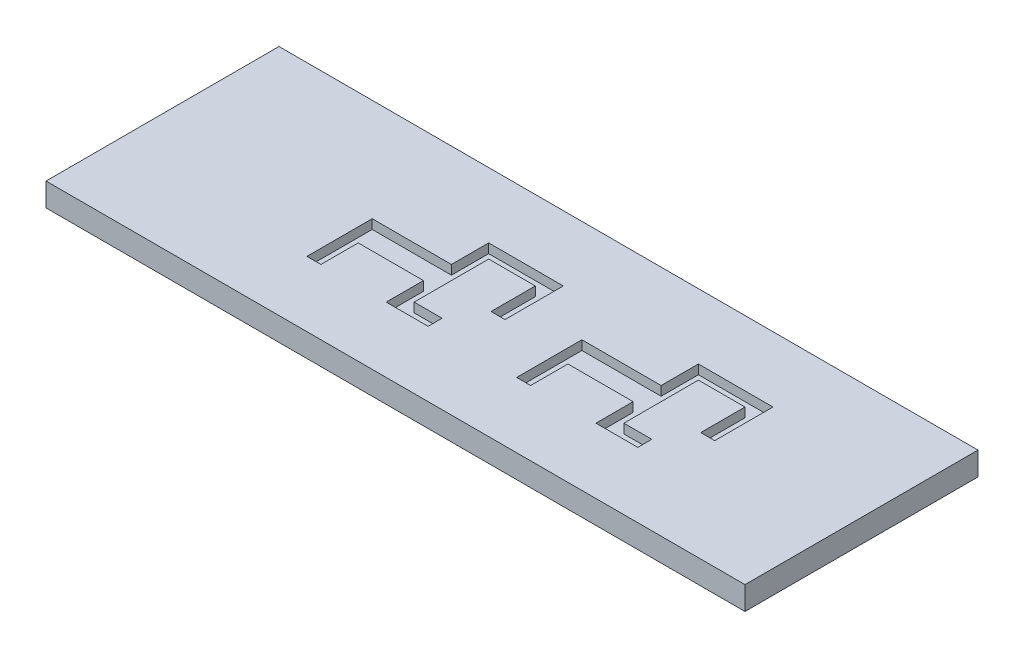
ISO-10303-21;
HEADER;
FILE_DESCRIPTION(('STEP AP214'),'2;1');
FILE_NAME('part.step','',(''),(''),'','','');
FILE_SCHEMA(('AUTOMOTIVE_DESIGN { 1 0 10303 214 1 1 1 1 }'));
ENDSEC;
DATA;
#1=APPLICATION_CONTEXT('core data for automotive mechanical design processes');
#2=APPLICATION_PROTOCOL_DEFINITION('international standard','automotive_design',2000,#1);
#3=PRODUCT_CONTEXT('',#1,'mechanical');
#4=PRODUCT('Part','Part','',(#3));
#5=PRODUCT_RELATED_PRODUCT_CATEGORY('part','',(#4));
#6=PRODUCT_DEFINITION_FORMATION('','',#4);
#7=PRODUCT_DEFINITION_CONTEXT('part definition',#1,'design');
#8=PRODUCT_DEFINITION('design','',#6,#7);
#9=PRODUCT_DEFINITION_SHAPE('','',#8);
#10=(LENGTH_UNIT() NAMED_UNIT(*) SI_UNIT(.MILLI.,.METRE.));
#11=(NAMED_UNIT(*) PLANE_ANGLE_UNIT() SI_UNIT($,.RADIAN.));
#12=(NAMED_UNIT(*) SI_UNIT($,.STERADIAN.) SOLID_ANGLE_UNIT());
#13=UNCERTAINTY_MEASURE_WITH_UNIT(LENGTH_MEASURE(1.E-05),#10,'distance_accuracy_value','');
#14=(GEOMETRIC_REPRESENTATION_CONTEXT(3) GLOBAL_UNCERTAINTY_ASSIGNED_CONTEXT((#13)) GLOBAL_UNIT_ASSIGNED_CONTEXT((#10,
#11,#12)) REPRESENTATION_CONTEXT('',''));
#15=CARTESIAN_POINT('',(0.,0.,0.));
#16=DIRECTION('',(0.,0.,1.));
#17=DIRECTION('',(1.,0.,0.));
#18=AXIS2_PLACEMENT_3D('',#15,#16,#17);
#19=CARTESIAN_POINT('',(37.5,2.5,12.5));
#20=DIRECTION('',(-1.,0.,0.));
#21=DIRECTION('',(0.,0.,1.));
#22=AXIS2_PLACEMENT_3D('',#19,#20,#21);
#23=PLANE('',#22);
#24=DIRECTION('',(0.,0.,-1.));
#25=VECTOR('',#24,1.);
#26=CARTESIAN_POINT('',(37.5,0.,12.5));
#27=LINE('',#26,#25);
#28=CARTESIAN_POINT('',(37.5,0.,12.5));
#29=VERTEX_POINT('',#28);
#30=CARTESIAN_POINT('',(37.5,0.,-12.5));
#31=VERTEX_POINT('',#30);
#32=EDGE_CURVE('E545',#29,#31,#27,.T.);
#33=ORIENTED_EDGE('',*,*,#32,.T.);
#34=DIRECTION('',(0.,-1.,0.));
#35=VECTOR('',#34,1.);
#36=CARTESIAN_POINT('',(37.5,2.5,-12.5));
#37=LINE('',#36,#35);
#38=CARTESIAN_POINT('',(37.5,2.5,-12.5));
#39=VERTEX_POINT('',#38);
#40=EDGE_CURVE('E12',#39,#31,#37,.T.);
#41=ORIENTED_EDGE('',*,*,#40,.F.);
#42=DIRECTION('',(0.,0.,-1.));
#43=VECTOR('',#42,1.);
#44=CARTESIAN_POINT('',(37.5,2.5,12.5));
#45=LINE('',#44,#43);
#46=CARTESIAN_POINT('',(37.5,2.5,12.5));
#47=VERTEX_POINT('',#46);
#48=EDGE_CURVE('E575',#47,#39,#45,.T.);
#49=ORIENTED_EDGE('',*,*,#48,.F.);
#50=DIRECTION('',(0.,-1.,0.));
#51=VECTOR('',#50,1.);
#52=CARTESIAN_POINT('',(37.5,2.5,12.5));
#53=LINE('',#52,#51);
#54=EDGE_CURVE('E585',#47,#29,#53,.T.);
#55=ORIENTED_EDGE('',*,*,#54,.T.);
#56=EDGE_LOOP('',(#33,#41,#49,#55));
#57=FACE_BOUND('',#56,.T.);
#58=ADVANCED_FACE('F93',(#57),#23,.F.);
#59=CARTESIAN_POINT('',(-37.5,2.5,-12.5));
#60=DIRECTION('',(0.,0.,1.));
#61=DIRECTION('',(1.,0.,0.));
#62=AXIS2_PLACEMENT_3D('',#59,#60,#61);
#63=PLANE('',#62);
#64=DIRECTION('',(-1.,0.,0.));
#65=VECTOR('',#64,1.);
#66=CARTESIAN_POINT('',(-37.5,0.,-12.5));
#67=LINE('',#66,#65);
#68=CARTESIAN_POINT('',(-37.5,0.,-12.5));
#69=VERTEX_POINT('',#68);
#70=EDGE_CURVE('E588',#31,#69,#67,.T.);
#71=ORIENTED_EDGE('',*,*,#70,.T.);
#72=DIRECTION('',(0.,-1.,0.));
#73=VECTOR('',#72,1.);
#74=CARTESIAN_POINT('',(-37.5,2.5,-12.5));
#75=LINE('',#74,#73);
#76=CARTESIAN_POINT('',(-37.5,2.5,-12.5));
#77=VERTEX_POINT('',#76);
#78=EDGE_CURVE('E100',#77,#69,#75,.T.);
#79=ORIENTED_EDGE('',*,*,#78,.F.);
#80=DIRECTION('',(-1.,0.,0.));
#81=VECTOR('',#80,1.);
#82=CARTESIAN_POINT('',(-37.5,2.5,-12.5));
#83=LINE('',#82,#81);
#84=EDGE_CURVE('E578',#39,#77,#83,.T.);
#85=ORIENTED_EDGE('',*,*,#84,.F.);
#86=ORIENTED_EDGE('',*,*,#40,.T.);
#87=EDGE_LOOP('',(#71,#79,#85,#86));
#88=FACE_BOUND('',#87,.T.);
#89=ADVANCED_FACE('F617',(#88),#63,.F.);
#90=CARTESIAN_POINT('',(-37.5,2.5,12.5));
#91=DIRECTION('',(1.,0.,0.));
#92=DIRECTION('',(0.,0.,-1.));
#93=AXIS2_PLACEMENT_3D('',#90,#91,#92);
#94=PLANE('',#93);
#95=DIRECTION('',(0.,0.,1.));
#96=VECTOR('',#95,1.);
#97=CARTESIAN_POINT('',(-37.5,0.,12.5));
#98=LINE('',#97,#96);
#99=CARTESIAN_POINT('',(-37.5,0.,12.5));
#100=VERTEX_POINT('',#99);
#101=EDGE_CURVE('E590',#69,#100,#98,.T.);
#102=ORIENTED_EDGE('',*,*,#101,.T.);
#103=DIRECTION('',(0.,-1.,0.));
#104=VECTOR('',#103,1.);
#105=CARTESIAN_POINT('',(-37.5,2.5,12.5));
#106=LINE('',#105,#104);
#107=CARTESIAN_POINT('',(-37.5,2.5,12.5));
#108=VERTEX_POINT('',#107);
#109=EDGE_CURVE('E595',#108,#100,#106,.T.);
#110=ORIENTED_EDGE('',*,*,#109,.F.);
#111=DIRECTION('',(0.,0.,1.));
#112=VECTOR('',#111,1.);
#113=CARTESIAN_POINT('',(-37.5,2.5,12.5));
#114=LINE('',#113,#112);
#115=EDGE_CURVE('E581',#77,#108,#114,.T.);
#116=ORIENTED_EDGE('',*,*,#115,.F.);
#117=ORIENTED_EDGE('',*,*,#78,.T.);
#118=EDGE_LOOP('',(#102,#110,#116,#117));
#119=FACE_BOUND('',#118,.T.);
#120=ADVANCED_FACE('F602',(#119),#94,.F.);
#121=CARTESIAN_POINT('',(-37.5,2.5,12.5));
#122=DIRECTION('',(0.,0.,-1.));
#123=DIRECTION('',(-1.,0.,0.));
#124=AXIS2_PLACEMENT_3D('',#121,#122,#123);
#125=PLANE('',#124);
#126=DIRECTION('',(1.,0.,0.));
#127=VECTOR('',#126,1.);
#128=CARTESIAN_POINT('',(-37.5,0.,12.5));
#129=LINE('',#128,#127);
#130=EDGE_CURVE('E579',#100,#29,#129,.T.);
#131=ORIENTED_EDGE('',*,*,#130,.T.);
#132=ORIENTED_EDGE('',*,*,#54,.F.);
#133=DIRECTION('',(1.,0.,0.));
#134=VECTOR('',#133,1.);
#135=CARTESIAN_POINT('',(-37.5,2.5,12.5));
#136=LINE('',#135,#134);
#137=EDGE_CURVE('E583',#108,#47,#136,.T.);
#138=ORIENTED_EDGE('',*,*,#137,.F.);
#139=ORIENTED_EDGE('',*,*,#109,.T.);
#140=EDGE_LOOP('',(#131,#132,#138,#139));
#141=FACE_BOUND('',#140,.T.);
#142=ADVANCED_FACE('F611',(#141),#125,.F.);
#143=CARTESIAN_POINT('',(0.,2.5,0.));
#144=DIRECTION('',(0.,-1.,0.));
#145=DIRECTION('',(0.,0.,-1.));
#146=AXIS2_PLACEMENT_3D('',#143,#144,#145);
#147=PLANE('',#146);
#148=DIRECTION('',(0.,0.,1.));
#149=VECTOR('',#148,1.);
#150=CARTESIAN_POINT('',(-1.49999999999999,2.5,-4.));
#151=LINE('',#150,#149);
#152=CARTESIAN_POINT('',(-1.49999999999999,2.5,-4.));
#153=VERTEX_POINT('',#152);
#154=CARTESIAN_POINT('',(-1.49999999999999,2.5,0.75));
#155=VERTEX_POINT('',#154);
#156=EDGE_CURVE('E341',#153,#155,#151,.T.);
#157=ORIENTED_EDGE('',*,*,#156,.F.);
#158=DIRECTION('',(1.,0.,0.));
#159=VECTOR('',#158,1.);
#160=CARTESIAN_POINT('',(0.,2.5,-4.));
#161=LINE('',#160,#159);
#162=CARTESIAN_POINT('',(-6.49999999999999,2.5,-4.));
#163=VERTEX_POINT('',#162);
#164=EDGE_CURVE('E395',#163,#153,#161,.T.);
#165=ORIENTED_EDGE('',*,*,#164,.F.);
#166=DIRECTION('',(0.,0.,-1.));
#167=VECTOR('',#166,1.);
#168=CARTESIAN_POINT('',(-6.49999999999999,2.5,0.));
#169=LINE('',#168,#167);
#170=CARTESIAN_POINT('',(-6.49999999999999,2.5,4.));
#171=VERTEX_POINT('',#170);
#172=EDGE_CURVE('E398',#171,#163,#169,.T.);
#173=ORIENTED_EDGE('',*,*,#172,.F.);
#174=DIRECTION('',(1.,0.,0.));
#175=VECTOR('',#174,1.);
#176=CARTESIAN_POINT('',(0.,2.5,4.));
#177=LINE('',#176,#175);
#178=CARTESIAN_POINT('',(-3.49999999999999,2.5,4.));
#179=VERTEX_POINT('',#178);
#180=EDGE_CURVE('E401',#171,#179,#177,.T.);
#181=ORIENTED_EDGE('',*,*,#180,.T.);
#182=DIRECTION('',(0.,0.,1.));
#183=VECTOR('',#182,1.);
#184=CARTESIAN_POINT('',(-3.49999999999999,2.5,0.));
#185=LINE('',#184,#183);
#186=CARTESIAN_POINT('',(-3.49999999999999,2.5,5.5));
#187=VERTEX_POINT('',#186);
#188=EDGE_CURVE('E404',#179,#187,#185,.T.);
#189=ORIENTED_EDGE('',*,*,#188,.T.);
#190=DIRECTION('',(1.,0.,0.));
#191=VECTOR('',#190,1.);
#192=CARTESIAN_POINT('',(0.,2.5,5.5));
#193=LINE('',#192,#191);
#194=CARTESIAN_POINT('',(-7.99999999999999,2.5,5.5));
#195=VERTEX_POINT('',#194);
#196=EDGE_CURVE('E407',#195,#187,#193,.T.);
#197=ORIENTED_EDGE('',*,*,#196,.F.);
#198=DIRECTION('',(0.,0.,1.));
#199=VECTOR('',#198,1.);
#200=CARTESIAN_POINT('',(-7.99999999999999,2.5,0.));
#201=LINE('',#200,#199);
#202=CARTESIAN_POINT('',(-7.99999999999999,2.5,1.5));
#203=VERTEX_POINT('',#202);
#204=EDGE_CURVE('E410',#203,#195,#201,.T.);
#205=ORIENTED_EDGE('',*,*,#204,.F.);
#206=DIRECTION('',(1.,0.,0.));
#207=VECTOR('',#206,1.);
#208=CARTESIAN_POINT('',(0.,2.5,1.5));
#209=LINE('',#208,#207);
#210=CARTESIAN_POINT('',(-15.,2.5,1.5));
#211=VERTEX_POINT('',#210);
#212=EDGE_CURVE('E413',#211,#203,#209,.T.);
#213=ORIENTED_EDGE('',*,*,#212,.F.);
#214=DIRECTION('',(0.,0.,1.));
#215=VECTOR('',#214,1.);
#216=CARTESIAN_POINT('',(-15.,2.5,0.));
#217=LINE('',#216,#215);
#218=CARTESIAN_POINT('',(-15.,2.5,5.5));
#219=VERTEX_POINT('',#218);
#220=EDGE_CURVE('E416',#211,#219,#217,.T.);
#221=ORIENTED_EDGE('',*,*,#220,.T.);
#222=DIRECTION('',(1.,0.,0.));
#223=VECTOR('',#222,1.);
#224=CARTESIAN_POINT('',(0.,2.5,5.50000000000001));
#225=LINE('',#224,#223);
#226=CARTESIAN_POINT('',(-16.5,2.5,5.5));
#227=VERTEX_POINT('',#226);
#228=EDGE_CURVE('E419',#227,#219,#225,.T.);
#229=ORIENTED_EDGE('',*,*,#228,.F.);
#230=DIRECTION('',(0.,0.,-1.));
#231=VECTOR('',#230,1.);
#232=CARTESIAN_POINT('',(-16.5,2.5,0.));
#233=LINE('',#232,#231);
#234=CARTESIAN_POINT('',(-16.5,2.5,-1.5));
#235=VERTEX_POINT('',#234);
#236=EDGE_CURVE('E334',#227,#235,#233,.T.);
#237=ORIENTED_EDGE('',*,*,#236,.T.);
#238=DIRECTION('',(1.,0.,0.));
#239=VECTOR('',#238,1.);
#240=CARTESIAN_POINT('',(0.,2.5,-1.5));
#241=LINE('',#240,#239);
#242=CARTESIAN_POINT('',(-7.99999999999999,2.5,-1.5));
#243=VERTEX_POINT('',#242);
#244=EDGE_CURVE('E388',#235,#243,#241,.T.);
#245=ORIENTED_EDGE('',*,*,#244,.T.);
#246=DIRECTION('',(0.,0.,-1.));
#247=VECTOR('',#246,1.);
#248=CARTESIAN_POINT('',(-7.99999999999999,2.5,0.));
#249=LINE('',#248,#247);
#250=CARTESIAN_POINT('',(-7.99999999999999,2.5,-5.5));
#251=VERTEX_POINT('',#250);
#252=EDGE_CURVE('E391',#243,#251,#249,.T.);
#253=ORIENTED_EDGE('',*,*,#252,.T.);
#254=DIRECTION('',(1.,0.,0.));
#255=VECTOR('',#254,1.);
#256=CARTESIAN_POINT('',(0.,2.5,-5.5));
#257=LINE('',#256,#255);
#258=CARTESIAN_POINT('',(0.,2.5,-5.5));
#259=VERTEX_POINT('',#258);
#260=EDGE_CURVE('E348',#251,#259,#257,.T.);
#261=ORIENTED_EDGE('',*,*,#260,.T.);
#262=DIRECTION('',(0.,0.,1.));
#263=VECTOR('',#262,1.);
#264=CARTESIAN_POINT('',(0.,2.5,-4.));
#265=LINE('',#264,#263);
#266=CARTESIAN_POINT('',(0.,2.5,0.75));
#267=VERTEX_POINT('',#266);
#268=EDGE_CURVE('E330',#259,#267,#265,.T.);
#269=ORIENTED_EDGE('',*,*,#268,.T.);
#270=DIRECTION('',(-1.,0.,0.));
#271=VECTOR('',#270,1.);
#272=CARTESIAN_POINT('',(0.,2.5,0.75));
#273=LINE('',#272,#271);
#274=EDGE_CURVE('E337',#267,#155,#273,.T.);
#275=ORIENTED_EDGE('',*,*,#274,.T.);
#276=EDGE_LOOP('',(#157,#165,#173,#181,#189,#197,#205,#213,#221,#229,#237,#245,#253,#261,#269,#275));
#277=FACE_BOUND('',#276,.T.);
#278=DIRECTION('',(1.,0.,0.));
#279=VECTOR('',#278,1.);
#280=CARTESIAN_POINT('',(0.,2.5,-4.));
#281=LINE('',#280,#279);
#282=CARTESIAN_POINT('',(16.,2.5,-4.));
#283=VERTEX_POINT('',#282);
#284=CARTESIAN_POINT('',(21.,2.5,-4.));
#285=VERTEX_POINT('',#284);
#286=EDGE_CURVE('E499',#283,#285,#281,.T.);
#287=ORIENTED_EDGE('',*,*,#286,.F.);
#288=DIRECTION('',(0.,0.,-1.));
#289=VECTOR('',#288,1.);
#290=CARTESIAN_POINT('',(16.,2.5,0.));
#291=LINE('',#290,#289);
#292=CARTESIAN_POINT('',(16.,2.5,4.));
#293=VERTEX_POINT('',#292);
#294=EDGE_CURVE('E115',#293,#283,#291,.T.);
#295=ORIENTED_EDGE('',*,*,#294,.F.);
#296=DIRECTION('',(1.,0.,0.));
#297=VECTOR('',#296,1.);
#298=CARTESIAN_POINT('',(0.,2.5,4.));
#299=LINE('',#298,#297);
#300=CARTESIAN_POINT('',(19.,2.5,4.));
#301=VERTEX_POINT('',#300);
#302=EDGE_CURVE('E460',#293,#301,#299,.T.);
#303=ORIENTED_EDGE('',*,*,#302,.T.);
#304=DIRECTION('',(0.,0.,1.));
#305=VECTOR('',#304,1.);
#306=CARTESIAN_POINT('',(19.,2.5,0.));
#307=LINE('',#306,#305);
#308=CARTESIAN_POINT('',(19.,2.5,5.5));
#309=VERTEX_POINT('',#308);
#310=EDGE_CURVE('E538',#301,#309,#307,.T.);
#311=ORIENTED_EDGE('',*,*,#310,.T.);
#312=DIRECTION('',(1.,0.,0.));
#313=VECTOR('',#312,1.);
#314=CARTESIAN_POINT('',(0.,2.5,5.5));
#315=LINE('',#314,#313);
#316=CARTESIAN_POINT('',(14.5,2.5,5.5));
#317=VERTEX_POINT('',#316);
#318=EDGE_CURVE('E535',#317,#309,#315,.T.);
#319=ORIENTED_EDGE('',*,*,#318,.F.);
#320=DIRECTION('',(0.,0.,1.));
#321=VECTOR('',#320,1.);
#322=CARTESIAN_POINT('',(14.5,2.5,0.));
#323=LINE('',#322,#321);
#324=CARTESIAN_POINT('',(14.5,2.5,1.5));
#325=VERTEX_POINT('',#324);
#326=EDGE_CURVE('E532',#325,#317,#323,.T.);
#327=ORIENTED_EDGE('',*,*,#326,.F.);
#328=DIRECTION('',(1.,0.,0.));
#329=VECTOR('',#328,1.);
#330=CARTESIAN_POINT('',(0.,2.5,1.5));
#331=LINE('',#330,#329);
#332=CARTESIAN_POINT('',(7.50000000000001,2.5,1.5));
#333=VERTEX_POINT('',#332);
#334=EDGE_CURVE('E529',#333,#325,#331,.T.);
#335=ORIENTED_EDGE('',*,*,#334,.F.);
#336=DIRECTION('',(0.,0.,1.));
#337=VECTOR('',#336,1.);
#338=CARTESIAN_POINT('',(7.50000000000001,2.5,0.));
#339=LINE('',#338,#337);
#340=CARTESIAN_POINT('',(7.50000000000001,2.5,5.5));
#341=VERTEX_POINT('',#340);
#342=EDGE_CURVE('E526',#333,#341,#339,.T.);
#343=ORIENTED_EDGE('',*,*,#342,.T.);
#344=DIRECTION('',(1.,0.,0.));
#345=VECTOR('',#344,1.);
#346=CARTESIAN_POINT('',(0.,2.5,5.5));
#347=LINE('',#346,#345);
#348=CARTESIAN_POINT('',(6.00000000000001,2.5,5.5));
#349=VERTEX_POINT('',#348);
#350=EDGE_CURVE('E523',#349,#341,#347,.T.);
#351=ORIENTED_EDGE('',*,*,#350,.F.);
#352=DIRECTION('',(0.,0.,-1.));
#353=VECTOR('',#352,1.);
#354=CARTESIAN_POINT('',(6.00000000000001,2.5,0.));
#355=LINE('',#354,#353);
#356=CARTESIAN_POINT('',(6.00000000000001,2.5,-1.5));
#357=VERTEX_POINT('',#356);
#358=EDGE_CURVE('E520',#349,#357,#355,.T.);
#359=ORIENTED_EDGE('',*,*,#358,.T.);
#360=DIRECTION('',(1.,0.,0.));
#361=VECTOR('',#360,1.);
#362=CARTESIAN_POINT('',(0.,2.5,-1.5));
#363=LINE('',#362,#361);
#364=CARTESIAN_POINT('',(14.5,2.5,-1.5));
#365=VERTEX_POINT('',#364);
#366=EDGE_CURVE('E517',#357,#365,#363,.T.);
#367=ORIENTED_EDGE('',*,*,#366,.T.);
#368=DIRECTION('',(0.,0.,-1.));
#369=VECTOR('',#368,1.);
#370=CARTESIAN_POINT('',(14.5,2.5,0.));
#371=LINE('',#370,#369);
#372=CARTESIAN_POINT('',(14.5,2.5,-5.5));
#373=VERTEX_POINT('',#372);
#374=EDGE_CURVE('E514',#365,#373,#371,.T.);
#375=ORIENTED_EDGE('',*,*,#374,.T.);
#376=DIRECTION('',(1.,0.,0.));
#377=VECTOR('',#376,1.);
#378=CARTESIAN_POINT('',(0.,2.5,-5.5));
#379=LINE('',#378,#377);
#380=CARTESIAN_POINT('',(22.5,2.5,-5.5));
#381=VERTEX_POINT('',#380);
#382=EDGE_CURVE('E511',#373,#381,#379,.T.);
#383=ORIENTED_EDGE('',*,*,#382,.T.);
#384=DIRECTION('',(0.,0.,-1.));
#385=VECTOR('',#384,1.);
#386=CARTESIAN_POINT('',(22.5,2.5,0.));
#387=LINE('',#386,#385);
#388=CARTESIAN_POINT('',(22.5,2.5,0.75));
#389=VERTEX_POINT('',#388);
#390=EDGE_CURVE('E508',#389,#381,#387,.T.);
#391=ORIENTED_EDGE('',*,*,#390,.F.);
#392=DIRECTION('',(-1.,0.,0.));
#393=VECTOR('',#392,1.);
#394=CARTESIAN_POINT('',(0.,2.5,0.750000000000001));
#395=LINE('',#394,#393);
#396=CARTESIAN_POINT('',(21.,2.5,0.75));
#397=VERTEX_POINT('',#396);
#398=EDGE_CURVE('E505',#389,#397,#395,.T.);
#399=ORIENTED_EDGE('',*,*,#398,.T.);
#400=DIRECTION('',(0.,0.,1.));
#401=VECTOR('',#400,1.);
#402=CARTESIAN_POINT('',(21.,2.5,0.));
#403=LINE('',#402,#401);
#404=EDGE_CURVE('E502',#285,#397,#403,.T.);
#405=ORIENTED_EDGE('',*,*,#404,.F.);
#406=EDGE_LOOP('',(#287,#295,#303,#311,#319,#327,#335,#343,#351,#359,#367,#375,#383,#391,#399,#405));
#407=FACE_BOUND('',#406,.T.);
#408=ORIENTED_EDGE('',*,*,#48,.T.);
#409=ORIENTED_EDGE('',*,*,#84,.T.);
#410=ORIENTED_EDGE('',*,*,#115,.T.);
#411=ORIENTED_EDGE('',*,*,#137,.T.);
#412=EDGE_LOOP('',(#408,#409,#410,#411));
#413=FACE_BOUND('',#412,.T.);
#414=ADVANCED_FACE('F344',(#277,#407,#413),#147,.F.);
#415=CARTESIAN_POINT('',(0.,0.,0.));
#416=DIRECTION('',(0.,-1.,0.));
#417=DIRECTION('',(0.,0.,-1.));
#418=AXIS2_PLACEMENT_3D('',#415,#416,#417);
#419=PLANE('',#418);
#420=ORIENTED_EDGE('',*,*,#32,.F.);
#421=ORIENTED_EDGE('',*,*,#130,.F.);
#422=ORIENTED_EDGE('',*,*,#101,.F.);
#423=ORIENTED_EDGE('',*,*,#70,.F.);
#424=EDGE_LOOP('',(#420,#421,#422,#423));
#425=FACE_BOUND('',#424,.T.);
#426=ADVANCED_FACE('F608',(#425),#419,.T.);
#427=CARTESIAN_POINT('',(16.,1.5,0.));
#428=DIRECTION('',(1.,0.,0.));
#429=DIRECTION('',(0.,0.,-1.));
#430=AXIS2_PLACEMENT_3D('',#427,#428,#429);
#431=PLANE('',#430);
#432=ORIENTED_EDGE('',*,*,#294,.T.);
#433=DIRECTION('',(0.,1.,0.));
#434=VECTOR('',#433,1.);
#435=CARTESIAN_POINT('',(16.,1.5,-4.));
#436=LINE('',#435,#434);
#437=CARTESIAN_POINT('',(16.,1.5,-4.));
#438=VERTEX_POINT('',#437);
#439=EDGE_CURVE('E497',#438,#283,#436,.T.);
#440=ORIENTED_EDGE('',*,*,#439,.F.);
#441=DIRECTION('',(0.,0.,-1.));
#442=VECTOR('',#441,1.);
#443=CARTESIAN_POINT('',(16.,1.5,0.));
#444=LINE('',#443,#442);
#445=CARTESIAN_POINT('',(16.,1.5,4.));
#446=VERTEX_POINT('',#445);
#447=EDGE_CURVE('E456',#446,#438,#444,.T.);
#448=ORIENTED_EDGE('',*,*,#447,.F.);
#449=DIRECTION('',(0.,1.,0.));
#450=VECTOR('',#449,1.);
#451=CARTESIAN_POINT('',(16.,1.5,4.));
#452=LINE('',#451,#450);
#453=EDGE_CURVE('E543',#446,#293,#452,.T.);
#454=ORIENTED_EDGE('',*,*,#453,.T.);
#455=EDGE_LOOP('',(#432,#440,#448,#454));
#456=FACE_BOUND('',#455,.T.);
#457=ADVANCED_FACE('F629',(#456),#431,.F.);
#458=CARTESIAN_POINT('',(0.,1.5,4.));
#459=DIRECTION('',(0.,0.,1.));
#460=DIRECTION('',(1.,0.,0.));
#461=AXIS2_PLACEMENT_3D('',#458,#459,#460);
#462=PLANE('',#461);
#463=ORIENTED_EDGE('',*,*,#302,.F.);
#464=ORIENTED_EDGE('',*,*,#453,.F.);
#465=DIRECTION('',(1.,0.,0.));
#466=VECTOR('',#465,1.);
#467=CARTESIAN_POINT('',(0.,1.5,4.));
#468=LINE('',#467,#466);
#469=CARTESIAN_POINT('',(19.,1.5,4.));
#470=VERTEX_POINT('',#469);
#471=EDGE_CURVE('E495',#446,#470,#468,.T.);
#472=ORIENTED_EDGE('',*,*,#471,.T.);
#473=DIRECTION('',(0.,1.,0.));
#474=VECTOR('',#473,1.);
#475=CARTESIAN_POINT('',(19.,1.5,4.));
#476=LINE('',#475,#474);
#477=EDGE_CURVE('E546',#470,#301,#476,.T.);
#478=ORIENTED_EDGE('',*,*,#477,.T.);
#479=EDGE_LOOP('',(#463,#464,#472,#478));
#480=FACE_BOUND('',#479,.T.);
#481=ADVANCED_FACE('F634',(#480),#462,.T.);
#482=CARTESIAN_POINT('',(19.,1.5,0.));
#483=DIRECTION('',(-1.,0.,0.));
#484=DIRECTION('',(0.,0.,1.));
#485=AXIS2_PLACEMENT_3D('',#482,#483,#484);
#486=PLANE('',#485);
#487=ORIENTED_EDGE('',*,*,#310,.F.);
#488=ORIENTED_EDGE('',*,*,#477,.F.);
#489=DIRECTION('',(0.,0.,1.));
#490=VECTOR('',#489,1.);
#491=CARTESIAN_POINT('',(19.,1.5,0.));
#492=LINE('',#491,#490);
#493=CARTESIAN_POINT('',(19.,1.5,5.5));
#494=VERTEX_POINT('',#493);
#495=EDGE_CURVE('E493',#470,#494,#492,.T.);
#496=ORIENTED_EDGE('',*,*,#495,.T.);
#497=DIRECTION('',(0.,1.,0.));
#498=VECTOR('',#497,1.);
#499=CARTESIAN_POINT('',(19.,1.5,5.5));
#500=LINE('',#499,#498);
#501=EDGE_CURVE('E548',#494,#309,#500,.T.);
#502=ORIENTED_EDGE('',*,*,#501,.T.);
#503=EDGE_LOOP('',(#487,#488,#496,#502));
#504=FACE_BOUND('',#503,.T.);
#505=ADVANCED_FACE('F687',(#504),#486,.T.);
#506=CARTESIAN_POINT('',(0.,1.5,5.5));
#507=DIRECTION('',(0.,0.,1.));
#508=DIRECTION('',(1.,0.,0.));
#509=AXIS2_PLACEMENT_3D('',#506,#507,#508);
#510=PLANE('',#509);
#511=ORIENTED_EDGE('',*,*,#318,.T.);
#512=ORIENTED_EDGE('',*,*,#501,.F.);
#513=DIRECTION('',(1.,0.,0.));
#514=VECTOR('',#513,1.);
#515=CARTESIAN_POINT('',(0.,1.5,5.5));
#516=LINE('',#515,#514);
#517=CARTESIAN_POINT('',(14.5,1.5,5.5));
#518=VERTEX_POINT('',#517);
#519=EDGE_CURVE('E490',#518,#494,#516,.T.);
#520=ORIENTED_EDGE('',*,*,#519,.F.);
#521=DIRECTION('',(0.,1.,0.));
#522=VECTOR('',#521,1.);
#523=CARTESIAN_POINT('',(14.5,1.5,5.5));
#524=LINE('',#523,#522);
#525=EDGE_CURVE('E550',#518,#317,#524,.T.);
#526=ORIENTED_EDGE('',*,*,#525,.T.);
#527=EDGE_LOOP('',(#511,#512,#520,#526));
#528=FACE_BOUND('',#527,.T.);
#529=ADVANCED_FACE('F683',(#528),#510,.F.);
#530=CARTESIAN_POINT('',(14.5,1.5,0.));
#531=DIRECTION('',(-1.,0.,0.));
#532=DIRECTION('',(0.,0.,1.));
#533=AXIS2_PLACEMENT_3D('',#530,#531,#532);
#534=PLANE('',#533);
#535=ORIENTED_EDGE('',*,*,#326,.T.);
#536=ORIENTED_EDGE('',*,*,#525,.F.);
#537=DIRECTION('',(0.,0.,1.));
#538=VECTOR('',#537,1.);
#539=CARTESIAN_POINT('',(14.5,1.5,0.));
#540=LINE('',#539,#538);
#541=CARTESIAN_POINT('',(14.5,1.5,1.5));
#542=VERTEX_POINT('',#541);
#543=EDGE_CURVE('E487',#542,#518,#540,.T.);
#544=ORIENTED_EDGE('',*,*,#543,.F.);
#545=DIRECTION('',(0.,1.,0.));
#546=VECTOR('',#545,1.);
#547=CARTESIAN_POINT('',(14.5,1.5,1.5));
#548=LINE('',#547,#546);
#549=EDGE_CURVE('E552',#542,#325,#548,.T.);
#550=ORIENTED_EDGE('',*,*,#549,.T.);
#551=EDGE_LOOP('',(#535,#536,#544,#550));
#552=FACE_BOUND('',#551,.T.);
#553=ADVANCED_FACE('F679',(#552),#534,.F.);
#554=CARTESIAN_POINT('',(0.,1.5,1.5));
#555=DIRECTION('',(0.,0.,1.));
#556=DIRECTION('',(1.,0.,0.));
#557=AXIS2_PLACEMENT_3D('',#554,#555,#556);
#558=PLANE('',#557);
#559=ORIENTED_EDGE('',*,*,#334,.T.);
#560=ORIENTED_EDGE('',*,*,#549,.F.);
#561=DIRECTION('',(1.,0.,0.));
#562=VECTOR('',#561,1.);
#563=CARTESIAN_POINT('',(0.,1.5,1.5));
#564=LINE('',#563,#562);
#565=CARTESIAN_POINT('',(7.50000000000001,1.5,1.5));
#566=VERTEX_POINT('',#565);
#567=EDGE_CURVE('E484',#566,#542,#564,.T.);
#568=ORIENTED_EDGE('',*,*,#567,.F.);
#569=DIRECTION('',(0.,1.,0.));
#570=VECTOR('',#569,1.);
#571=CARTESIAN_POINT('',(7.50000000000001,1.5,1.5));
#572=LINE('',#571,#570);
#573=EDGE_CURVE('E554',#566,#333,#572,.T.);
#574=ORIENTED_EDGE('',*,*,#573,.T.);
#575=EDGE_LOOP('',(#559,#560,#568,#574));
#576=FACE_BOUND('',#575,.T.);
#577=ADVANCED_FACE('F675',(#576),#558,.F.);
#578=CARTESIAN_POINT('',(7.50000000000001,1.5,0.));
#579=DIRECTION('',(-1.,0.,0.));
#580=DIRECTION('',(0.,0.,1.));
#581=AXIS2_PLACEMENT_3D('',#578,#579,#580);
#582=PLANE('',#581);
#583=ORIENTED_EDGE('',*,*,#342,.F.);
#584=ORIENTED_EDGE('',*,*,#573,.F.);
#585=DIRECTION('',(0.,0.,1.));
#586=VECTOR('',#585,1.);
#587=CARTESIAN_POINT('',(7.50000000000001,1.5,0.));
#588=LINE('',#587,#586);
#589=CARTESIAN_POINT('',(7.50000000000001,1.5,5.5));
#590=VERTEX_POINT('',#589);
#591=EDGE_CURVE('E482',#566,#590,#588,.T.);
#592=ORIENTED_EDGE('',*,*,#591,.T.);
#593=DIRECTION('',(0.,1.,0.));
#594=VECTOR('',#593,1.);
#595=CARTESIAN_POINT('',(7.50000000000001,1.5,5.5));
#596=LINE('',#595,#594);
#597=EDGE_CURVE('E556',#590,#341,#596,.T.);
#598=ORIENTED_EDGE('',*,*,#597,.T.);
#599=EDGE_LOOP('',(#583,#584,#592,#598));
#600=FACE_BOUND('',#599,.T.);
#601=ADVANCED_FACE('F671',(#600),#582,.T.);
#602=CARTESIAN_POINT('',(0.,1.5,5.5));
#603=DIRECTION('',(0.,0.,1.));
#604=DIRECTION('',(1.,0.,0.));
#605=AXIS2_PLACEMENT_3D('',#602,#603,#604);
#606=PLANE('',#605);
#607=ORIENTED_EDGE('',*,*,#350,.T.);
#608=ORIENTED_EDGE('',*,*,#597,.F.);
#609=DIRECTION('',(1.,0.,0.));
#610=VECTOR('',#609,1.);
#611=CARTESIAN_POINT('',(0.,1.5,5.5));
#612=LINE('',#611,#610);
#613=CARTESIAN_POINT('',(6.00000000000001,1.5,5.5));
#614=VERTEX_POINT('',#613);
#615=EDGE_CURVE('E479',#614,#590,#612,.T.);
#616=ORIENTED_EDGE('',*,*,#615,.F.);
#617=DIRECTION('',(0.,1.,0.));
#618=VECTOR('',#617,1.);
#619=CARTESIAN_POINT('',(6.00000000000001,1.5,5.5));
#620=LINE('',#619,#618);
#621=EDGE_CURVE('E558',#614,#349,#620,.T.);
#622=ORIENTED_EDGE('',*,*,#621,.T.);
#623=EDGE_LOOP('',(#607,#608,#616,#622));
#624=FACE_BOUND('',#623,.T.);
#625=ADVANCED_FACE('F667',(#624),#606,.F.);
#626=CARTESIAN_POINT('',(6.00000000000001,1.5,0.));
#627=DIRECTION('',(1.,0.,0.));
#628=DIRECTION('',(0.,0.,-1.));
#629=AXIS2_PLACEMENT_3D('',#626,#627,#628);
#630=PLANE('',#629);
#631=ORIENTED_EDGE('',*,*,#358,.F.);
#632=ORIENTED_EDGE('',*,*,#621,.F.);
#633=DIRECTION('',(0.,0.,-1.));
#634=VECTOR('',#633,1.);
#635=CARTESIAN_POINT('',(6.00000000000001,1.5,0.));
#636=LINE('',#635,#634);
#637=CARTESIAN_POINT('',(6.00000000000001,1.5,-1.5));
#638=VERTEX_POINT('',#637);
#639=EDGE_CURVE('E477',#614,#638,#636,.T.);
#640=ORIENTED_EDGE('',*,*,#639,.T.);
#641=DIRECTION('',(0.,1.,0.));
#642=VECTOR('',#641,1.);
#643=CARTESIAN_POINT('',(6.00000000000001,1.5,-1.5));
#644=LINE('',#643,#642);
#645=EDGE_CURVE('E560',#638,#357,#644,.T.);
#646=ORIENTED_EDGE('',*,*,#645,.T.);
#647=EDGE_LOOP('',(#631,#632,#640,#646));
#648=FACE_BOUND('',#647,.T.);
#649=ADVANCED_FACE('F663',(#648),#630,.T.);
#650=CARTESIAN_POINT('',(0.,1.5,-1.5));
#651=DIRECTION('',(0.,0.,1.));
#652=DIRECTION('',(1.,0.,0.));
#653=AXIS2_PLACEMENT_3D('',#650,#651,#652);
#654=PLANE('',#653);
#655=ORIENTED_EDGE('',*,*,#366,.F.);
#656=ORIENTED_EDGE('',*,*,#645,.F.);
#657=DIRECTION('',(1.,0.,0.));
#658=VECTOR('',#657,1.);
#659=CARTESIAN_POINT('',(0.,1.5,-1.5));
#660=LINE('',#659,#658);
#661=CARTESIAN_POINT('',(14.5,1.5,-1.5));
#662=VERTEX_POINT('',#661);
#663=EDGE_CURVE('E475',#638,#662,#660,.T.);
#664=ORIENTED_EDGE('',*,*,#663,.T.);
#665=DIRECTION('',(0.,1.,0.));
#666=VECTOR('',#665,1.);
#667=CARTESIAN_POINT('',(14.5,1.5,-1.5));
#668=LINE('',#667,#666);
#669=EDGE_CURVE('E562',#662,#365,#668,.T.);
#670=ORIENTED_EDGE('',*,*,#669,.T.);
#671=EDGE_LOOP('',(#655,#656,#664,#670));
#672=FACE_BOUND('',#671,.T.);
#673=ADVANCED_FACE('F659',(#672),#654,.T.);
#674=CARTESIAN_POINT('',(14.5,1.5,0.));
#675=DIRECTION('',(1.,0.,0.));
#676=DIRECTION('',(0.,0.,-1.));
#677=AXIS2_PLACEMENT_3D('',#674,#675,#676);
#678=PLANE('',#677);
#679=ORIENTED_EDGE('',*,*,#374,.F.);
#680=ORIENTED_EDGE('',*,*,#669,.F.);
#681=DIRECTION('',(0.,0.,-1.));
#682=VECTOR('',#681,1.);
#683=CARTESIAN_POINT('',(14.5,1.5,0.));
#684=LINE('',#683,#682);
#685=CARTESIAN_POINT('',(14.5,1.5,-5.5));
#686=VERTEX_POINT('',#685);
#687=EDGE_CURVE('E473',#662,#686,#684,.T.);
#688=ORIENTED_EDGE('',*,*,#687,.T.);
#689=DIRECTION('',(0.,1.,0.));
#690=VECTOR('',#689,1.);
#691=CARTESIAN_POINT('',(14.5,1.5,-5.5));
#692=LINE('',#691,#690);
#693=EDGE_CURVE('E564',#686,#373,#692,.T.);
#694=ORIENTED_EDGE('',*,*,#693,.T.);
#695=EDGE_LOOP('',(#679,#680,#688,#694));
#696=FACE_BOUND('',#695,.T.);
#697=ADVANCED_FACE('F655',(#696),#678,.T.);
#698=CARTESIAN_POINT('',(0.,1.5,-5.5));
#699=DIRECTION('',(0.,0.,1.));
#700=DIRECTION('',(1.,0.,0.));
#701=AXIS2_PLACEMENT_3D('',#698,#699,#700);
#702=PLANE('',#701);
#703=ORIENTED_EDGE('',*,*,#382,.F.);
#704=ORIENTED_EDGE('',*,*,#693,.F.);
#705=DIRECTION('',(1.,0.,0.));
#706=VECTOR('',#705,1.);
#707=CARTESIAN_POINT('',(0.,1.5,-5.5));
#708=LINE('',#707,#706);
#709=CARTESIAN_POINT('',(22.5,1.5,-5.5));
#710=VERTEX_POINT('',#709);
#711=EDGE_CURVE('E471',#686,#710,#708,.T.);
#712=ORIENTED_EDGE('',*,*,#711,.T.);
#713=DIRECTION('',(0.,1.,0.));
#714=VECTOR('',#713,1.);
#715=CARTESIAN_POINT('',(22.5,1.5,-5.5));
#716=LINE('',#715,#714);
#717=EDGE_CURVE('E566',#710,#381,#716,.T.);
#718=ORIENTED_EDGE('',*,*,#717,.T.);
#719=EDGE_LOOP('',(#703,#704,#712,#718));
#720=FACE_BOUND('',#719,.T.);
#721=ADVANCED_FACE('F651',(#720),#702,.T.);
#722=CARTESIAN_POINT('',(22.5,1.5,0.));
#723=DIRECTION('',(1.,0.,0.));
#724=DIRECTION('',(0.,0.,-1.));
#725=AXIS2_PLACEMENT_3D('',#722,#723,#724);
#726=PLANE('',#725);
#727=ORIENTED_EDGE('',*,*,#390,.T.);
#728=ORIENTED_EDGE('',*,*,#717,.F.);
#729=DIRECTION('',(0.,0.,-1.));
#730=VECTOR('',#729,1.);
#731=CARTESIAN_POINT('',(22.5,1.5,0.));
#732=LINE('',#731,#730);
#733=CARTESIAN_POINT('',(22.5,1.5,0.75));
#734=VERTEX_POINT('',#733);
#735=EDGE_CURVE('E468',#734,#710,#732,.T.);
#736=ORIENTED_EDGE('',*,*,#735,.F.);
#737=DIRECTION('',(0.,1.,0.));
#738=VECTOR('',#737,1.);
#739=CARTESIAN_POINT('',(22.5,1.5,0.75));
#740=LINE('',#739,#738);
#741=EDGE_CURVE('E568',#734,#389,#740,.T.);
#742=ORIENTED_EDGE('',*,*,#741,.T.);
#743=EDGE_LOOP('',(#727,#728,#736,#742));
#744=FACE_BOUND('',#743,.T.);
#745=ADVANCED_FACE('F647',(#744),#726,.F.);
#746=CARTESIAN_POINT('',(0.,1.5,0.750000000000001));
#747=DIRECTION('',(0.,0.,-1.));
#748=DIRECTION('',(-1.,0.,0.));
#749=AXIS2_PLACEMENT_3D('',#746,#747,#748);
#750=PLANE('',#749);
#751=ORIENTED_EDGE('',*,*,#398,.F.);
#752=ORIENTED_EDGE('',*,*,#741,.F.);
#753=DIRECTION('',(-1.,0.,0.));
#754=VECTOR('',#753,1.);
#755=CARTESIAN_POINT('',(0.,1.5,0.750000000000001));
#756=LINE('',#755,#754);
#757=CARTESIAN_POINT('',(21.,1.5,0.75));
#758=VERTEX_POINT('',#757);
#759=EDGE_CURVE('E466',#734,#758,#756,.T.);
#760=ORIENTED_EDGE('',*,*,#759,.T.);
#761=DIRECTION('',(0.,1.,0.));
#762=VECTOR('',#761,1.);
#763=CARTESIAN_POINT('',(21.,1.5,0.75));
#764=LINE('',#763,#762);
#765=EDGE_CURVE('E570',#758,#397,#764,.T.);
#766=ORIENTED_EDGE('',*,*,#765,.T.);
#767=EDGE_LOOP('',(#751,#752,#760,#766));
#768=FACE_BOUND('',#767,.T.);
#769=ADVANCED_FACE('F643',(#768),#750,.T.);
#770=CARTESIAN_POINT('',(21.,1.5,0.));
#771=DIRECTION('',(-1.,0.,0.));
#772=DIRECTION('',(0.,0.,1.));
#773=AXIS2_PLACEMENT_3D('',#770,#771,#772);
#774=PLANE('',#773);
#775=ORIENTED_EDGE('',*,*,#404,.T.);
#776=ORIENTED_EDGE('',*,*,#765,.F.);
#777=DIRECTION('',(0.,0.,1.));
#778=VECTOR('',#777,1.);
#779=CARTESIAN_POINT('',(21.,1.5,0.));
#780=LINE('',#779,#778);
#781=CARTESIAN_POINT('',(21.,1.5,-4.));
#782=VERTEX_POINT('',#781);
#783=EDGE_CURVE('E463',#782,#758,#780,.T.);
#784=ORIENTED_EDGE('',*,*,#783,.F.);
#785=DIRECTION('',(0.,1.,0.));
#786=VECTOR('',#785,1.);
#787=CARTESIAN_POINT('',(21.,1.5,-4.));
#788=LINE('',#787,#786);
#789=EDGE_CURVE('E572',#782,#285,#788,.T.);
#790=ORIENTED_EDGE('',*,*,#789,.T.);
#791=EDGE_LOOP('',(#775,#776,#784,#790));
#792=FACE_BOUND('',#791,.T.);
#793=ADVANCED_FACE('F639',(#792),#774,.F.);
#794=CARTESIAN_POINT('',(0.,1.5,-4.));
#795=DIRECTION('',(0.,0.,1.));
#796=DIRECTION('',(1.,0.,0.));
#797=AXIS2_PLACEMENT_3D('',#794,#795,#796);
#798=PLANE('',#797);
#799=ORIENTED_EDGE('',*,*,#286,.T.);
#800=ORIENTED_EDGE('',*,*,#789,.F.);
#801=DIRECTION('',(1.,0.,0.));
#802=VECTOR('',#801,1.);
#803=CARTESIAN_POINT('',(0.,1.5,-4.));
#804=LINE('',#803,#802);
#805=EDGE_CURVE('E459',#438,#782,#804,.T.);
#806=ORIENTED_EDGE('',*,*,#805,.F.);
#807=ORIENTED_EDGE('',*,*,#439,.T.);
#808=EDGE_LOOP('',(#799,#800,#806,#807));
#809=FACE_BOUND('',#808,.T.);
#810=ADVANCED_FACE('F635',(#809),#798,.F.);
#811=CARTESIAN_POINT('',(0.,1.5,0.));
#812=DIRECTION('',(0.,1.,0.));
#813=DIRECTION('',(0.,0.,1.));
#814=AXIS2_PLACEMENT_3D('',#811,#812,#813);
#815=PLANE('',#814);
#816=ORIENTED_EDGE('',*,*,#447,.T.);
#817=ORIENTED_EDGE('',*,*,#805,.T.);
#818=ORIENTED_EDGE('',*,*,#783,.T.);
#819=ORIENTED_EDGE('',*,*,#759,.F.);
#820=ORIENTED_EDGE('',*,*,#735,.T.);
#821=ORIENTED_EDGE('',*,*,#711,.F.);
#822=ORIENTED_EDGE('',*,*,#687,.F.);
#823=ORIENTED_EDGE('',*,*,#663,.F.);
#824=ORIENTED_EDGE('',*,*,#639,.F.);
#825=ORIENTED_EDGE('',*,*,#615,.T.);
#826=ORIENTED_EDGE('',*,*,#591,.F.);
#827=ORIENTED_EDGE('',*,*,#567,.T.);
#828=ORIENTED_EDGE('',*,*,#543,.T.);
#829=ORIENTED_EDGE('',*,*,#519,.T.);
#830=ORIENTED_EDGE('',*,*,#495,.F.);
#831=ORIENTED_EDGE('',*,*,#471,.F.);
#832=EDGE_LOOP('',(#816,#817,#818,#819,#820,#821,#822,#823,#824,#825,#826,#827,#828,#829,#830,#831));
#833=FACE_BOUND('',#832,.T.);
#834=ADVANCED_FACE('F638',(#833),#815,.T.);
#835=CARTESIAN_POINT('',(0.,1.5,0.));
#836=DIRECTION('',(1.,0.,0.));
#837=DIRECTION('',(0.,0.,-1.));
#838=AXIS2_PLACEMENT_3D('',#835,#836,#837);
#839=PLANE('',#838);
#840=DIRECTION('',(0.,0.,1.));
#841=VECTOR('',#840,1.);
#842=CARTESIAN_POINT('',(0.,1.5,-4.));
#843=LINE('',#842,#841);
#844=CARTESIAN_POINT('',(0.,1.5,-5.5));
#845=VERTEX_POINT('',#844);
#846=CARTESIAN_POINT('',(0.,1.5,0.75));
#847=VERTEX_POINT('',#846);
#848=EDGE_CURVE('E332',#845,#847,#843,.T.);
#849=ORIENTED_EDGE('',*,*,#848,.T.);
#850=DIRECTION('',(0.,1.,0.));
#851=VECTOR('',#850,1.);
#852=CARTESIAN_POINT('',(0.,1.5,0.75));
#853=LINE('',#852,#851);
#854=EDGE_CURVE('E326',#847,#267,#853,.T.);
#855=ORIENTED_EDGE('',*,*,#854,.T.);
#856=ORIENTED_EDGE('',*,*,#268,.F.);
#857=DIRECTION('',(0.,1.,0.));
#858=VECTOR('',#857,1.);
#859=CARTESIAN_POINT('',(0.,1.5,-5.5));
#860=LINE('',#859,#858);
#861=EDGE_CURVE('E379',#845,#259,#860,.T.);
#862=ORIENTED_EDGE('',*,*,#861,.F.);
#863=EDGE_LOOP('',(#849,#855,#856,#862));
#864=FACE_BOUND('',#863,.T.);
#865=ADVANCED_FACE('F327',(#864),#839,.F.);
#866=CARTESIAN_POINT('',(-1.49999999999999,1.5,0.));
#867=DIRECTION('',(-1.,0.,0.));
#868=DIRECTION('',(0.,0.,1.));
#869=AXIS2_PLACEMENT_3D('',#866,#867,#868);
#870=PLANE('',#869);
#871=ORIENTED_EDGE('',*,*,#156,.T.);
#872=DIRECTION('',(0.,1.,0.));
#873=VECTOR('',#872,1.);
#874=CARTESIAN_POINT('',(-1.49999999999999,1.5,0.75));
#875=LINE('',#874,#873);
#876=CARTESIAN_POINT('',(-1.49999999999999,1.5,0.75));
#877=VERTEX_POINT('',#876);
#878=EDGE_CURVE('E107',#877,#155,#875,.T.);
#879=ORIENTED_EDGE('',*,*,#878,.F.);
#880=DIRECTION('',(0.,0.,1.));
#881=VECTOR('',#880,1.);
#882=CARTESIAN_POINT('',(-1.49999999999999,1.5,-4.));
#883=LINE('',#882,#881);
#884=CARTESIAN_POINT('',(-1.49999999999999,1.5,-4.));
#885=VERTEX_POINT('',#884);
#886=EDGE_CURVE('E349',#885,#877,#883,.T.);
#887=ORIENTED_EDGE('',*,*,#886,.F.);
#888=DIRECTION('',(0.,1.,0.));
#889=VECTOR('',#888,1.);
#890=CARTESIAN_POINT('',(-1.49999999999999,1.5,-4.));
#891=LINE('',#890,#889);
#892=EDGE_CURVE('E377',#885,#153,#891,.T.);
#893=ORIENTED_EDGE('',*,*,#892,.T.);
#894=EDGE_LOOP('',(#871,#879,#887,#893));
#895=FACE_BOUND('',#894,.T.);
#896=ADVANCED_FACE('F702',(#895),#870,.F.);
#897=CARTESIAN_POINT('',(0.,1.5,0.));
#898=DIRECTION('',(0.,1.,0.));
#899=DIRECTION('',(0.,0.,1.));
#900=AXIS2_PLACEMENT_3D('',#897,#898,#899);
#901=PLANE('',#900);
#902=ORIENTED_EDGE('',*,*,#886,.T.);
#903=DIRECTION('',(-1.,0.,0.));
#904=VECTOR('',#903,1.);
#905=CARTESIAN_POINT('',(0.,1.5,0.75));
#906=LINE('',#905,#904);
#907=EDGE_CURVE('E351',#847,#877,#906,.T.);
#908=ORIENTED_EDGE('',*,*,#907,.F.);
#909=ORIENTED_EDGE('',*,*,#848,.F.);
#910=DIRECTION('',(1.,0.,0.));
#911=VECTOR('',#910,1.);
#912=CARTESIAN_POINT('',(0.,1.5,-5.5));
#913=LINE('',#912,#911);
#914=CARTESIAN_POINT('',(-7.99999999999999,1.5,-5.5));
#915=VERTEX_POINT('',#914);
#916=EDGE_CURVE('E427',#915,#845,#913,.T.);
#917=ORIENTED_EDGE('',*,*,#916,.F.);
#918=DIRECTION('',(0.,0.,-1.));
#919=VECTOR('',#918,1.);
#920=CARTESIAN_POINT('',(-7.99999999999999,1.5,0.));
#921=LINE('',#920,#919);
#922=CARTESIAN_POINT('',(-7.99999999999999,1.5,-1.5));
#923=VERTEX_POINT('',#922);
#924=EDGE_CURVE('E425',#923,#915,#921,.T.);
#925=ORIENTED_EDGE('',*,*,#924,.F.);
#926=DIRECTION('',(1.,0.,0.));
#927=VECTOR('',#926,1.);
#928=CARTESIAN_POINT('',(0.,1.5,-1.5));
#929=LINE('',#928,#927);
#930=CARTESIAN_POINT('',(-16.5,1.5,-1.5));
#931=VERTEX_POINT('',#930);
#932=EDGE_CURVE('E360',#931,#923,#929,.T.);
#933=ORIENTED_EDGE('',*,*,#932,.F.);
#934=DIRECTION('',(0.,0.,-1.));
#935=VECTOR('',#934,1.);
#936=CARTESIAN_POINT('',(-16.5,1.5,0.));
#937=LINE('',#936,#935);
#938=CARTESIAN_POINT('',(-16.5,1.5,5.5));
#939=VERTEX_POINT('',#938);
#940=EDGE_CURVE('E392',#939,#931,#937,.T.);
#941=ORIENTED_EDGE('',*,*,#940,.F.);
#942=DIRECTION('',(1.,0.,0.));
#943=VECTOR('',#942,1.);
#944=CARTESIAN_POINT('',(0.,1.5,5.50000000000001));
#945=LINE('',#944,#943);
#946=CARTESIAN_POINT('',(-15.,1.5,5.5));
#947=VERTEX_POINT('',#946);
#948=EDGE_CURVE('E451',#939,#947,#945,.T.);
#949=ORIENTED_EDGE('',*,*,#948,.T.);
#950=DIRECTION('',(0.,0.,1.));
#951=VECTOR('',#950,1.);
#952=CARTESIAN_POINT('',(-15.,1.5,0.));
#953=LINE('',#952,#951);
#954=CARTESIAN_POINT('',(-15.,1.5,1.5));
#955=VERTEX_POINT('',#954);
#956=EDGE_CURVE('E449',#955,#947,#953,.T.);
#957=ORIENTED_EDGE('',*,*,#956,.F.);
#958=DIRECTION('',(1.,0.,0.));
#959=VECTOR('',#958,1.);
#960=CARTESIAN_POINT('',(0.,1.5,1.5));
#961=LINE('',#960,#959);
#962=CARTESIAN_POINT('',(-7.99999999999999,1.5,1.5));
#963=VERTEX_POINT('',#962);
#964=EDGE_CURVE('E446',#955,#963,#961,.T.);
#965=ORIENTED_EDGE('',*,*,#964,.T.);
#966=DIRECTION('',(0.,0.,1.));
#967=VECTOR('',#966,1.);
#968=CARTESIAN_POINT('',(-7.99999999999999,1.5,0.));
#969=LINE('',#968,#967);
#970=CARTESIAN_POINT('',(-7.99999999999999,1.5,5.5));
#971=VERTEX_POINT('',#970);
#972=EDGE_CURVE('E443',#963,#971,#969,.T.);
#973=ORIENTED_EDGE('',*,*,#972,.T.);
#974=DIRECTION('',(1.,0.,0.));
#975=VECTOR('',#974,1.);
#976=CARTESIAN_POINT('',(0.,1.5,5.5));
#977=LINE('',#976,#975);
#978=CARTESIAN_POINT('',(-3.49999999999999,1.5,5.5));
#979=VERTEX_POINT('',#978);
#980=EDGE_CURVE('E440',#971,#979,#977,.T.);
#981=ORIENTED_EDGE('',*,*,#980,.T.);
#982=DIRECTION('',(0.,0.,1.));
#983=VECTOR('',#982,1.);
#984=CARTESIAN_POINT('',(-3.49999999999999,1.5,0.));
#985=LINE('',#984,#983);
#986=CARTESIAN_POINT('',(-3.49999999999999,1.5,4.));
#987=VERTEX_POINT('',#986);
#988=EDGE_CURVE('E438',#987,#979,#985,.T.);
#989=ORIENTED_EDGE('',*,*,#988,.F.);
#990=DIRECTION('',(1.,0.,0.));
#991=VECTOR('',#990,1.);
#992=CARTESIAN_POINT('',(0.,1.5,4.));
#993=LINE('',#992,#991);
#994=CARTESIAN_POINT('',(-6.49999999999999,1.5,4.));
#995=VERTEX_POINT('',#994);
#996=EDGE_CURVE('E436',#995,#987,#993,.T.);
#997=ORIENTED_EDGE('',*,*,#996,.F.);
#998=DIRECTION('',(0.,0.,-1.));
#999=VECTOR('',#998,1.);
#1000=CARTESIAN_POINT('',(-6.49999999999999,1.5,0.));
#1001=LINE('',#1000,#999);
#1002=CARTESIAN_POINT('',(-6.49999999999999,1.5,-4.));
#1003=VERTEX_POINT('',#1002);
#1004=EDGE_CURVE('E433',#995,#1003,#1001,.T.);
#1005=ORIENTED_EDGE('',*,*,#1004,.T.);
#1006=DIRECTION('',(1.,0.,0.));
#1007=VECTOR('',#1006,1.);
#1008=CARTESIAN_POINT('',(0.,1.5,-4.));
#1009=LINE('',#1008,#1007);
#1010=EDGE_CURVE('E430',#1003,#885,#1009,.T.);
#1011=ORIENTED_EDGE('',*,*,#1010,.T.);
#1012=EDGE_LOOP('',(#902,#908,#909,#917,#925,#933,#941,#949,#957,#965,#973,#981,#989,#997,#1005,#1011));
#1013=FACE_BOUND('',#1012,.T.);
#1014=ADVANCED_FACE('F698',(#1013),#901,.T.);
#1015=CARTESIAN_POINT('',(0.,1.5,-4.));
#1016=DIRECTION('',(0.,0.,1.));
#1017=DIRECTION('',(1.,0.,0.));
#1018=AXIS2_PLACEMENT_3D('',#1015,#1016,#1017);
#1019=PLANE('',#1018);
#1020=ORIENTED_EDGE('',*,*,#164,.T.);
#1021=ORIENTED_EDGE('',*,*,#892,.F.);
#1022=ORIENTED_EDGE('',*,*,#1010,.F.);
#1023=DIRECTION('',(0.,1.,0.));
#1024=VECTOR('',#1023,1.);
#1025=CARTESIAN_POINT('',(-6.49999999999999,1.5,-4.));
#1026=LINE('',#1025,#1024);
#1027=EDGE_CURVE('E375',#1003,#163,#1026,.T.);
#1028=ORIENTED_EDGE('',*,*,#1027,.T.);
#1029=EDGE_LOOP('',(#1020,#1021,#1022,#1028));
#1030=FACE_BOUND('',#1029,.T.);
#1031=ADVANCED_FACE('F701',(#1030),#1019,.F.);
#1032=CARTESIAN_POINT('',(-6.49999999999999,1.5,0.));
#1033=DIRECTION('',(1.,0.,0.));
#1034=DIRECTION('',(0.,0.,-1.));
#1035=AXIS2_PLACEMENT_3D('',#1032,#1033,#1034);
#1036=PLANE('',#1035);
#1037=ORIENTED_EDGE('',*,*,#172,.T.);
#1038=ORIENTED_EDGE('',*,*,#1027,.F.);
#1039=ORIENTED_EDGE('',*,*,#1004,.F.);
#1040=DIRECTION('',(0.,1.,0.));
#1041=VECTOR('',#1040,1.);
#1042=CARTESIAN_POINT('',(-6.49999999999999,1.5,4.));
#1043=LINE('',#1042,#1041);
#1044=EDGE_CURVE('E373',#995,#171,#1043,.T.);
#1045=ORIENTED_EDGE('',*,*,#1044,.T.);
#1046=EDGE_LOOP('',(#1037,#1038,#1039,#1045));
#1047=FACE_BOUND('',#1046,.T.);
#1048=ADVANCED_FACE('F724',(#1047),#1036,.F.);
#1049=CARTESIAN_POINT('',(0.,1.5,4.));
#1050=DIRECTION('',(0.,0.,1.));
#1051=DIRECTION('',(1.,0.,0.));
#1052=AXIS2_PLACEMENT_3D('',#1049,#1050,#1051);
#1053=PLANE('',#1052);
#1054=ORIENTED_EDGE('',*,*,#180,.F.);
#1055=ORIENTED_EDGE('',*,*,#1044,.F.);
#1056=ORIENTED_EDGE('',*,*,#996,.T.);
#1057=DIRECTION('',(0.,1.,0.));
#1058=VECTOR('',#1057,1.);
#1059=CARTESIAN_POINT('',(-3.49999999999999,1.5,4.));
#1060=LINE('',#1059,#1058);
#1061=EDGE_CURVE('E371',#987,#179,#1060,.T.);
#1062=ORIENTED_EDGE('',*,*,#1061,.T.);
#1063=EDGE_LOOP('',(#1054,#1055,#1056,#1062));
#1064=FACE_BOUND('',#1063,.T.);
#1065=ADVANCED_FACE('F728',(#1064),#1053,.T.);
#1066=CARTESIAN_POINT('',(-3.49999999999999,1.5,0.));
#1067=DIRECTION('',(-1.,0.,0.));
#1068=DIRECTION('',(0.,0.,1.));
#1069=AXIS2_PLACEMENT_3D('',#1066,#1067,#1068);
#1070=PLANE('',#1069);
#1071=ORIENTED_EDGE('',*,*,#188,.F.);
#1072=ORIENTED_EDGE('',*,*,#1061,.F.);
#1073=ORIENTED_EDGE('',*,*,#988,.T.);
#1074=DIRECTION('',(0.,1.,0.));
#1075=VECTOR('',#1074,1.);
#1076=CARTESIAN_POINT('',(-3.49999999999999,1.5,5.5));
#1077=LINE('',#1076,#1075);
#1078=EDGE_CURVE('E369',#979,#187,#1077,.T.);
#1079=ORIENTED_EDGE('',*,*,#1078,.T.);
#1080=EDGE_LOOP('',(#1071,#1072,#1073,#1079));
#1081=FACE_BOUND('',#1080,.T.);
#1082=ADVANCED_FACE('F732',(#1081),#1070,.T.);
#1083=CARTESIAN_POINT('',(0.,1.5,5.5));
#1084=DIRECTION('',(0.,0.,1.));
#1085=DIRECTION('',(1.,0.,0.));
#1086=AXIS2_PLACEMENT_3D('',#1083,#1084,#1085);
#1087=PLANE('',#1086);
#1088=ORIENTED_EDGE('',*,*,#196,.T.);
#1089=ORIENTED_EDGE('',*,*,#1078,.F.);
#1090=ORIENTED_EDGE('',*,*,#980,.F.);
#1091=DIRECTION('',(0.,1.,0.));
#1092=VECTOR('',#1091,1.);
#1093=CARTESIAN_POINT('',(-7.99999999999999,1.5,5.5));
#1094=LINE('',#1093,#1092);
#1095=EDGE_CURVE('E367',#971,#195,#1094,.T.);
#1096=ORIENTED_EDGE('',*,*,#1095,.T.);
#1097=EDGE_LOOP('',(#1088,#1089,#1090,#1096));
#1098=FACE_BOUND('',#1097,.T.);
#1099=ADVANCED_FACE('F736',(#1098),#1087,.F.);
#1100=CARTESIAN_POINT('',(-7.99999999999999,1.5,0.));
#1101=DIRECTION('',(-1.,0.,0.));
#1102=DIRECTION('',(0.,0.,1.));
#1103=AXIS2_PLACEMENT_3D('',#1100,#1101,#1102);
#1104=PLANE('',#1103);
#1105=ORIENTED_EDGE('',*,*,#204,.T.);
#1106=ORIENTED_EDGE('',*,*,#1095,.F.);
#1107=ORIENTED_EDGE('',*,*,#972,.F.);
#1108=DIRECTION('',(0.,1.,0.));
#1109=VECTOR('',#1108,1.);
#1110=CARTESIAN_POINT('',(-7.99999999999999,1.5,1.5));
#1111=LINE('',#1110,#1109);
#1112=EDGE_CURVE('E365',#963,#203,#1111,.T.);
#1113=ORIENTED_EDGE('',*,*,#1112,.T.);
#1114=EDGE_LOOP('',(#1105,#1106,#1107,#1113));
#1115=FACE_BOUND('',#1114,.T.);
#1116=ADVANCED_FACE('F740',(#1115),#1104,.F.);
#1117=CARTESIAN_POINT('',(0.,1.5,1.5));
#1118=DIRECTION('',(0.,0.,1.));
#1119=DIRECTION('',(1.,0.,0.));
#1120=AXIS2_PLACEMENT_3D('',#1117,#1118,#1119);
#1121=PLANE('',#1120);
#1122=ORIENTED_EDGE('',*,*,#212,.T.);
#1123=ORIENTED_EDGE('',*,*,#1112,.F.);
#1124=ORIENTED_EDGE('',*,*,#964,.F.);
#1125=DIRECTION('',(0.,1.,0.));
#1126=VECTOR('',#1125,1.);
#1127=CARTESIAN_POINT('',(-15.,1.5,1.5));
#1128=LINE('',#1127,#1126);
#1129=EDGE_CURVE('E363',#955,#211,#1128,.T.);
#1130=ORIENTED_EDGE('',*,*,#1129,.T.);
#1131=EDGE_LOOP('',(#1122,#1123,#1124,#1130));
#1132=FACE_BOUND('',#1131,.T.);
#1133=ADVANCED_FACE('F744',(#1132),#1121,.F.);
#1134=CARTESIAN_POINT('',(-15.,1.5,0.));
#1135=DIRECTION('',(-1.,0.,0.));
#1136=DIRECTION('',(0.,0.,1.));
#1137=AXIS2_PLACEMENT_3D('',#1134,#1135,#1136);
#1138=PLANE('',#1137);
#1139=ORIENTED_EDGE('',*,*,#220,.F.);
#1140=ORIENTED_EDGE('',*,*,#1129,.F.);
#1141=ORIENTED_EDGE('',*,*,#956,.T.);
#1142=DIRECTION('',(0.,1.,0.));
#1143=VECTOR('',#1142,1.);
#1144=CARTESIAN_POINT('',(-15.,1.5,5.5));
#1145=LINE('',#1144,#1143);
#1146=EDGE_CURVE('E361',#947,#219,#1145,.T.);
#1147=ORIENTED_EDGE('',*,*,#1146,.T.);
#1148=EDGE_LOOP('',(#1139,#1140,#1141,#1147));
#1149=FACE_BOUND('',#1148,.T.);
#1150=ADVANCED_FACE('F748',(#1149),#1138,.T.);
#1151=CARTESIAN_POINT('',(0.,1.5,5.50000000000001));
#1152=DIRECTION('',(0.,0.,1.));
#1153=DIRECTION('',(1.,0.,0.));
#1154=AXIS2_PLACEMENT_3D('',#1151,#1152,#1153);
#1155=PLANE('',#1154);
#1156=ORIENTED_EDGE('',*,*,#228,.T.);
#1157=ORIENTED_EDGE('',*,*,#1146,.F.);
#1158=ORIENTED_EDGE('',*,*,#948,.F.);
#1159=DIRECTION('',(0.,1.,0.));
#1160=VECTOR('',#1159,1.);
#1161=CARTESIAN_POINT('',(-16.5,1.5,5.5));
#1162=LINE('',#1161,#1160);
#1163=EDGE_CURVE('E358',#939,#227,#1162,.T.);
#1164=ORIENTED_EDGE('',*,*,#1163,.T.);
#1165=EDGE_LOOP('',(#1156,#1157,#1158,#1164));
#1166=FACE_BOUND('',#1165,.T.);
#1167=ADVANCED_FACE('F752',(#1166),#1155,.F.);
#1168=CARTESIAN_POINT('',(-16.5,1.5,0.));
#1169=DIRECTION('',(1.,0.,0.));
#1170=DIRECTION('',(0.,0.,-1.));
#1171=AXIS2_PLACEMENT_3D('',#1168,#1169,#1170);
#1172=PLANE('',#1171);
#1173=ORIENTED_EDGE('',*,*,#236,.F.);
#1174=ORIENTED_EDGE('',*,*,#1163,.F.);
#1175=ORIENTED_EDGE('',*,*,#940,.T.);
#1176=DIRECTION('',(0.,1.,0.));
#1177=VECTOR('',#1176,1.);
#1178=CARTESIAN_POINT('',(-16.5,1.5,-1.5));
#1179=LINE('',#1178,#1177);
#1180=EDGE_CURVE('E385',#931,#235,#1179,.T.);
#1181=ORIENTED_EDGE('',*,*,#1180,.T.);
#1182=EDGE_LOOP('',(#1173,#1174,#1175,#1181));
#1183=FACE_BOUND('',#1182,.T.);
#1184=ADVANCED_FACE('F708',(#1183),#1172,.T.);
#1185=CARTESIAN_POINT('',(0.,1.5,-1.5));
#1186=DIRECTION('',(0.,0.,1.));
#1187=DIRECTION('',(1.,0.,0.));
#1188=AXIS2_PLACEMENT_3D('',#1185,#1186,#1187);
#1189=PLANE('',#1188);
#1190=ORIENTED_EDGE('',*,*,#244,.F.);
#1191=ORIENTED_EDGE('',*,*,#1180,.F.);
#1192=ORIENTED_EDGE('',*,*,#932,.T.);
#1193=DIRECTION('',(0.,1.,0.));
#1194=VECTOR('',#1193,1.);
#1195=CARTESIAN_POINT('',(-7.99999999999999,1.5,-1.5));
#1196=LINE('',#1195,#1194);
#1197=EDGE_CURVE('E383',#923,#243,#1196,.T.);
#1198=ORIENTED_EDGE('',*,*,#1197,.T.);
#1199=EDGE_LOOP('',(#1190,#1191,#1192,#1198));
#1200=FACE_BOUND('',#1199,.T.);
#1201=ADVANCED_FACE('F704',(#1200),#1189,.T.);
#1202=CARTESIAN_POINT('',(-7.99999999999999,1.5,0.));
#1203=DIRECTION('',(1.,0.,0.));
#1204=DIRECTION('',(0.,0.,-1.));
#1205=AXIS2_PLACEMENT_3D('',#1202,#1203,#1204);
#1206=PLANE('',#1205);
#1207=ORIENTED_EDGE('',*,*,#252,.F.);
#1208=ORIENTED_EDGE('',*,*,#1197,.F.);
#1209=ORIENTED_EDGE('',*,*,#924,.T.);
#1210=DIRECTION('',(0.,1.,0.));
#1211=VECTOR('',#1210,1.);
#1212=CARTESIAN_POINT('',(-7.99999999999999,1.5,-5.5));
#1213=LINE('',#1212,#1211);
#1214=EDGE_CURVE('E381',#915,#251,#1213,.T.);
#1215=ORIENTED_EDGE('',*,*,#1214,.T.);
#1216=EDGE_LOOP('',(#1207,#1208,#1209,#1215));
#1217=FACE_BOUND('',#1216,.T.);
#1218=ADVANCED_FACE('F707',(#1217),#1206,.T.);
#1219=CARTESIAN_POINT('',(0.,1.5,-5.5));
#1220=DIRECTION('',(0.,0.,1.));
#1221=DIRECTION('',(1.,0.,0.));
#1222=AXIS2_PLACEMENT_3D('',#1219,#1220,#1221);
#1223=PLANE('',#1222);
#1224=ORIENTED_EDGE('',*,*,#260,.F.);
#1225=ORIENTED_EDGE('',*,*,#1214,.F.);
#1226=ORIENTED_EDGE('',*,*,#916,.T.);
#1227=ORIENTED_EDGE('',*,*,#861,.T.);
#1228=EDGE_LOOP('',(#1224,#1225,#1226,#1227));
#1229=FACE_BOUND('',#1228,.T.);
#1230=ADVANCED_FACE('F712',(#1229),#1223,.T.);
#1231=CARTESIAN_POINT('',(0.,1.5,0.75));
#1232=DIRECTION('',(0.,0.,-1.));
#1233=DIRECTION('',(-1.,0.,0.));
#1234=AXIS2_PLACEMENT_3D('',#1231,#1232,#1233);
#1235=PLANE('',#1234);
#1236=ORIENTED_EDGE('',*,*,#274,.F.);
#1237=ORIENTED_EDGE('',*,*,#854,.F.);
#1238=ORIENTED_EDGE('',*,*,#907,.T.);
#1239=ORIENTED_EDGE('',*,*,#878,.T.);
#1240=EDGE_LOOP('',(#1236,#1237,#1238,#1239));
#1241=FACE_BOUND('',#1240,.T.);
#1242=ADVANCED_FACE('F338',(#1241),#1235,.T.);
#1243=CLOSED_SHELL('',(#58,#89,#120,#142,#414,#426,#457,#481,#505,#529,#553,#577,#601,#625,#649,
#673,#697,#721,#745,#769,#793,#810,#834,#865,#896,#1014,#1031,#1048,#1065,#1082,#1099,#1116,
#1133,#1150,#1167,#1184,#1201,#1218,#1230,#1242));
#1244=MANIFOLD_SOLID_BREP('B2',#1243);
#1245=ADVANCED_BREP_SHAPE_REPRESENTATION('',(#18,#1244),#14);
#1246=SHAPE_DEFINITION_REPRESENTATION(#9,#1245);
ENDSEC;
END-ISO-10303-21;
